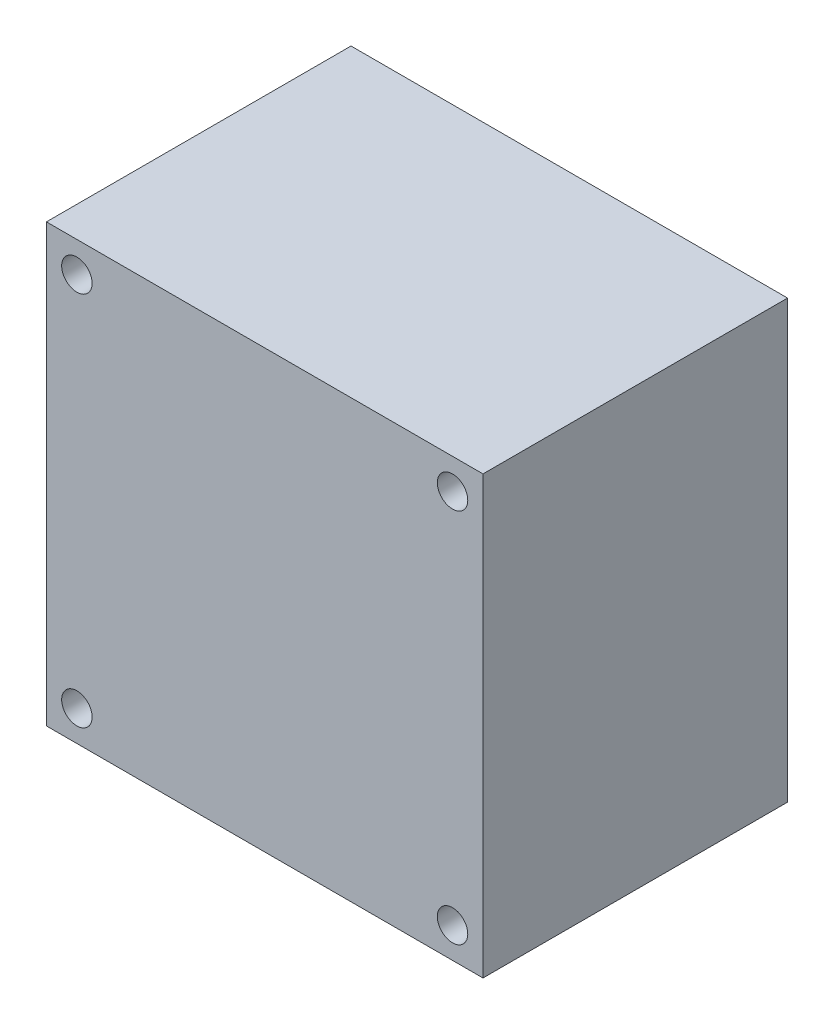
ISO-10303-21;
HEADER;
FILE_DESCRIPTION(('STEP AP214'),'2;1');
FILE_NAME('part.step','',(''),(''),'','','');
FILE_SCHEMA(('AUTOMOTIVE_DESIGN { 1 0 10303 214 1 1 1 1 }'));
ENDSEC;
DATA;
#1=APPLICATION_CONTEXT('core data for automotive mechanical design processes');
#2=APPLICATION_PROTOCOL_DEFINITION('international standard','automotive_design',2000,#1);
#3=PRODUCT_CONTEXT('',#1,'mechanical');
#4=PRODUCT('Part','Part','',(#3));
#5=PRODUCT_RELATED_PRODUCT_CATEGORY('part','',(#4));
#6=PRODUCT_DEFINITION_FORMATION('','',#4);
#7=PRODUCT_DEFINITION_CONTEXT('part definition',#1,'design');
#8=PRODUCT_DEFINITION('design','',#6,#7);
#9=PRODUCT_DEFINITION_SHAPE('','',#8);
#10=(LENGTH_UNIT() NAMED_UNIT(*) SI_UNIT(.MILLI.,.METRE.));
#11=(NAMED_UNIT(*) PLANE_ANGLE_UNIT() SI_UNIT($,.RADIAN.));
#12=(NAMED_UNIT(*) SI_UNIT($,.STERADIAN.) SOLID_ANGLE_UNIT());
#13=UNCERTAINTY_MEASURE_WITH_UNIT(LENGTH_MEASURE(1.E-05),#10,'distance_accuracy_value','');
#14=(GEOMETRIC_REPRESENTATION_CONTEXT(3) GLOBAL_UNCERTAINTY_ASSIGNED_CONTEXT((#13)) GLOBAL_UNIT_ASSIGNED_CONTEXT((#10,
#11,#12)) REPRESENTATION_CONTEXT('',''));
#15=CARTESIAN_POINT('',(0.,0.,0.));
#16=DIRECTION('',(0.,0.,1.));
#17=DIRECTION('',(1.,0.,0.));
#18=AXIS2_PLACEMENT_3D('',#15,#16,#17);
#19=CARTESIAN_POINT('',(0.,0.,30.));
#20=DIRECTION('',(1.,0.,0.));
#21=DIRECTION('',(0.,0.,-1.));
#22=AXIS2_PLACEMENT_3D('',#19,#20,#21);
#23=PLANE('',#22);
#24=DIRECTION('',(0.,-1.,0.));
#25=VECTOR('',#24,1.);
#26=CARTESIAN_POINT('',(0.,0.,0.));
#27=LINE('',#26,#25);
#28=CARTESIAN_POINT('',(0.,43.,0.));
#29=VERTEX_POINT('',#28);
#30=CARTESIAN_POINT('',(0.,0.,0.));
#31=VERTEX_POINT('',#30);
#32=EDGE_CURVE('E95',#29,#31,#27,.T.);
#33=ORIENTED_EDGE('',*,*,#32,.T.);
#34=DIRECTION('',(0.,0.,-1.));
#35=VECTOR('',#34,1.);
#36=CARTESIAN_POINT('',(0.,0.,30.));
#37=LINE('',#36,#35);
#38=CARTESIAN_POINT('',(0.,0.,30.));
#39=VERTEX_POINT('',#38);
#40=EDGE_CURVE('E11',#39,#31,#37,.T.);
#41=ORIENTED_EDGE('',*,*,#40,.F.);
#42=DIRECTION('',(0.,-1.,0.));
#43=VECTOR('',#42,1.);
#44=CARTESIAN_POINT('',(0.,0.,30.));
#45=LINE('',#44,#43);
#46=CARTESIAN_POINT('',(0.,43.,30.));
#47=VERTEX_POINT('',#46);
#48=EDGE_CURVE('E83',#47,#39,#45,.T.);
#49=ORIENTED_EDGE('',*,*,#48,.F.);
#50=DIRECTION('',(0.,0.,-1.));
#51=VECTOR('',#50,1.);
#52=CARTESIAN_POINT('',(0.,43.,30.));
#53=LINE('',#52,#51);
#54=EDGE_CURVE('E91',#47,#29,#53,.T.);
#55=ORIENTED_EDGE('',*,*,#54,.T.);
#56=EDGE_LOOP('',(#33,#41,#49,#55));
#57=FACE_BOUND('',#56,.T.);
#58=ADVANCED_FACE('F32',(#57),#23,.F.);
#59=CARTESIAN_POINT('',(0.,0.,30.));
#60=DIRECTION('',(0.,1.,0.));
#61=DIRECTION('',(0.,0.,1.));
#62=AXIS2_PLACEMENT_3D('',#59,#60,#61);
#63=PLANE('',#62);
#64=DIRECTION('',(1.,0.,0.));
#65=VECTOR('',#64,1.);
#66=CARTESIAN_POINT('',(0.,0.,0.));
#67=LINE('',#66,#65);
#68=CARTESIAN_POINT('',(43.,0.,0.));
#69=VERTEX_POINT('',#68);
#70=EDGE_CURVE('E87',#31,#69,#67,.T.);
#71=ORIENTED_EDGE('',*,*,#70,.T.);
#72=DIRECTION('',(0.,0.,-1.));
#73=VECTOR('',#72,1.);
#74=CARTESIAN_POINT('',(43.,0.,30.));
#75=LINE('',#74,#73);
#76=CARTESIAN_POINT('',(43.,0.,30.));
#77=VERTEX_POINT('',#76);
#78=EDGE_CURVE('E40',#77,#69,#75,.T.);
#79=ORIENTED_EDGE('',*,*,#78,.F.);
#80=DIRECTION('',(1.,0.,0.));
#81=VECTOR('',#80,1.);
#82=CARTESIAN_POINT('',(0.,0.,30.));
#83=LINE('',#82,#81);
#84=EDGE_CURVE('E78',#39,#77,#83,.T.);
#85=ORIENTED_EDGE('',*,*,#84,.F.);
#86=ORIENTED_EDGE('',*,*,#40,.T.);
#87=EDGE_LOOP('',(#71,#79,#85,#86));
#88=FACE_BOUND('',#87,.T.);
#89=ADVANCED_FACE('F86',(#88),#63,.F.);
#90=CARTESIAN_POINT('',(43.,0.,30.));
#91=DIRECTION('',(-1.,0.,0.));
#92=DIRECTION('',(0.,0.,1.));
#93=AXIS2_PLACEMENT_3D('',#90,#91,#92);
#94=PLANE('',#93);
#95=DIRECTION('',(0.,1.,0.));
#96=VECTOR('',#95,1.);
#97=CARTESIAN_POINT('',(43.,0.,0.));
#98=LINE('',#97,#96);
#99=CARTESIAN_POINT('',(43.,43.,0.));
#100=VERTEX_POINT('',#99);
#101=EDGE_CURVE('E65',#69,#100,#98,.T.);
#102=ORIENTED_EDGE('',*,*,#101,.T.);
#103=DIRECTION('',(0.,0.,-1.));
#104=VECTOR('',#103,1.);
#105=CARTESIAN_POINT('',(43.,43.,30.));
#106=LINE('',#105,#104);
#107=CARTESIAN_POINT('',(43.,43.,30.));
#108=VERTEX_POINT('',#107);
#109=EDGE_CURVE('E88',#108,#100,#106,.T.);
#110=ORIENTED_EDGE('',*,*,#109,.F.);
#111=DIRECTION('',(0.,1.,0.));
#112=VECTOR('',#111,1.);
#113=CARTESIAN_POINT('',(43.,0.,30.));
#114=LINE('',#113,#112);
#115=EDGE_CURVE('E81',#77,#108,#114,.T.);
#116=ORIENTED_EDGE('',*,*,#115,.F.);
#117=ORIENTED_EDGE('',*,*,#78,.T.);
#118=EDGE_LOOP('',(#102,#110,#116,#117));
#119=FACE_BOUND('',#118,.T.);
#120=ADVANCED_FACE('F89',(#119),#94,.F.);
#121=CARTESIAN_POINT('',(0.,43.,30.));
#122=DIRECTION('',(0.,-1.,0.));
#123=DIRECTION('',(0.,0.,-1.));
#124=AXIS2_PLACEMENT_3D('',#121,#122,#123);
#125=PLANE('',#124);
#126=DIRECTION('',(-1.,0.,0.));
#127=VECTOR('',#126,1.);
#128=CARTESIAN_POINT('',(0.,43.,0.));
#129=LINE('',#128,#127);
#130=EDGE_CURVE('E71',#100,#29,#129,.T.);
#131=ORIENTED_EDGE('',*,*,#130,.T.);
#132=ORIENTED_EDGE('',*,*,#54,.F.);
#133=DIRECTION('',(-1.,0.,0.));
#134=VECTOR('',#133,1.);
#135=CARTESIAN_POINT('',(0.,43.,30.));
#136=LINE('',#135,#134);
#137=EDGE_CURVE('E48',#108,#47,#136,.T.);
#138=ORIENTED_EDGE('',*,*,#137,.F.);
#139=ORIENTED_EDGE('',*,*,#109,.T.);
#140=EDGE_LOOP('',(#131,#132,#138,#139));
#141=FACE_BOUND('',#140,.T.);
#142=ADVANCED_FACE('F103',(#141),#125,.F.);
#143=CARTESIAN_POINT('',(0.,0.,30.));
#144=DIRECTION('',(0.,0.,-1.));
#145=DIRECTION('',(-1.,0.,0.));
#146=AXIS2_PLACEMENT_3D('',#143,#144,#145);
#147=PLANE('',#146);
#148=CARTESIAN_POINT('',(3.,3.,30.));
#149=DIRECTION('',(0.,0.,1.));
#150=DIRECTION('',(1.,0.,0.));
#151=AXIS2_PLACEMENT_3D('',#148,#149,#150);
#152=CIRCLE('',#151,1.5);
#153=CARTESIAN_POINT('',(4.5,3.,30.));
#154=VERTEX_POINT('',#153);
#155=EDGE_CURVE('E127',#154,#154,#152,.T.);
#156=ORIENTED_EDGE('',*,*,#155,.F.);
#157=EDGE_LOOP('',(#156));
#158=FACE_BOUND('',#157,.T.);
#159=CARTESIAN_POINT('',(40.,3.,30.));
#160=DIRECTION('',(0.,0.,1.));
#161=DIRECTION('',(1.,0.,0.));
#162=AXIS2_PLACEMENT_3D('',#159,#160,#161);
#163=CIRCLE('',#162,1.5);
#164=CARTESIAN_POINT('',(41.5,3.,30.));
#165=VERTEX_POINT('',#164);
#166=EDGE_CURVE('E121',#165,#165,#163,.T.);
#167=ORIENTED_EDGE('',*,*,#166,.F.);
#168=EDGE_LOOP('',(#167));
#169=FACE_BOUND('',#168,.T.);
#170=CARTESIAN_POINT('',(40.,40.,30.));
#171=DIRECTION('',(0.,0.,1.));
#172=DIRECTION('',(1.,0.,0.));
#173=AXIS2_PLACEMENT_3D('',#170,#171,#172);
#174=CIRCLE('',#173,1.5);
#175=CARTESIAN_POINT('',(41.5,40.,30.));
#176=VERTEX_POINT('',#175);
#177=EDGE_CURVE('E115',#176,#176,#174,.T.);
#178=ORIENTED_EDGE('',*,*,#177,.F.);
#179=EDGE_LOOP('',(#178));
#180=FACE_BOUND('',#179,.T.);
#181=CARTESIAN_POINT('',(3.,40.,30.));
#182=DIRECTION('',(0.,0.,1.));
#183=DIRECTION('',(1.,0.,0.));
#184=AXIS2_PLACEMENT_3D('',#181,#182,#183);
#185=CIRCLE('',#184,1.5);
#186=CARTESIAN_POINT('',(4.5,40.,30.));
#187=VERTEX_POINT('',#186);
#188=EDGE_CURVE('E109',#187,#187,#185,.T.);
#189=ORIENTED_EDGE('',*,*,#188,.F.);
#190=EDGE_LOOP('',(#189));
#191=FACE_BOUND('',#190,.T.);
#192=ORIENTED_EDGE('',*,*,#48,.T.);
#193=ORIENTED_EDGE('',*,*,#84,.T.);
#194=ORIENTED_EDGE('',*,*,#115,.T.);
#195=ORIENTED_EDGE('',*,*,#137,.T.);
#196=EDGE_LOOP('',(#192,#193,#194,#195));
#197=FACE_BOUND('',#196,.T.);
#198=ADVANCED_FACE('F79',(#158,#169,#180,#191,#197),#147,.F.);
#199=CARTESIAN_POINT('',(0.,0.,0.));
#200=DIRECTION('',(0.,0.,-1.));
#201=DIRECTION('',(-1.,0.,0.));
#202=AXIS2_PLACEMENT_3D('',#199,#200,#201);
#203=PLANE('',#202);
#204=CARTESIAN_POINT('',(3.,3.,0.));
#205=DIRECTION('',(0.,0.,1.));
#206=DIRECTION('',(1.,0.,0.));
#207=AXIS2_PLACEMENT_3D('',#204,#205,#206);
#208=CIRCLE('',#207,1.5);
#209=CARTESIAN_POINT('',(4.5,3.,0.));
#210=VERTEX_POINT('',#209);
#211=EDGE_CURVE('E124',#210,#210,#208,.T.);
#212=ORIENTED_EDGE('',*,*,#211,.T.);
#213=EDGE_LOOP('',(#212));
#214=FACE_BOUND('',#213,.T.);
#215=CARTESIAN_POINT('',(40.,3.,0.));
#216=DIRECTION('',(0.,0.,1.));
#217=DIRECTION('',(1.,0.,0.));
#218=AXIS2_PLACEMENT_3D('',#215,#216,#217);
#219=CIRCLE('',#218,1.5);
#220=CARTESIAN_POINT('',(41.5,3.,0.));
#221=VERTEX_POINT('',#220);
#222=EDGE_CURVE('E118',#221,#221,#219,.T.);
#223=ORIENTED_EDGE('',*,*,#222,.T.);
#224=EDGE_LOOP('',(#223));
#225=FACE_BOUND('',#224,.T.);
#226=CARTESIAN_POINT('',(40.,40.,0.));
#227=DIRECTION('',(0.,0.,1.));
#228=DIRECTION('',(1.,0.,0.));
#229=AXIS2_PLACEMENT_3D('',#226,#227,#228);
#230=CIRCLE('',#229,1.5);
#231=CARTESIAN_POINT('',(41.5,40.,0.));
#232=VERTEX_POINT('',#231);
#233=EDGE_CURVE('E112',#232,#232,#230,.T.);
#234=ORIENTED_EDGE('',*,*,#233,.T.);
#235=EDGE_LOOP('',(#234));
#236=FACE_BOUND('',#235,.T.);
#237=CARTESIAN_POINT('',(3.,40.,0.));
#238=DIRECTION('',(0.,0.,1.));
#239=DIRECTION('',(1.,0.,0.));
#240=AXIS2_PLACEMENT_3D('',#237,#238,#239);
#241=CIRCLE('',#240,1.5);
#242=CARTESIAN_POINT('',(4.5,40.,0.));
#243=VERTEX_POINT('',#242);
#244=EDGE_CURVE('E98',#243,#243,#241,.T.);
#245=ORIENTED_EDGE('',*,*,#244,.T.);
#246=EDGE_LOOP('',(#245));
#247=FACE_BOUND('',#246,.T.);
#248=ORIENTED_EDGE('',*,*,#32,.F.);
#249=ORIENTED_EDGE('',*,*,#130,.F.);
#250=ORIENTED_EDGE('',*,*,#101,.F.);
#251=ORIENTED_EDGE('',*,*,#70,.F.);
#252=EDGE_LOOP('',(#248,#249,#250,#251));
#253=FACE_BOUND('',#252,.T.);
#254=ADVANCED_FACE('F106',(#214,#225,#236,#247,#253),#203,.T.);
#255=CARTESIAN_POINT('',(3.,40.,0.));
#256=DIRECTION('',(0.,0.,1.));
#257=DIRECTION('',(1.,0.,0.));
#258=AXIS2_PLACEMENT_3D('',#255,#256,#257);
#259=CYLINDRICAL_SURFACE('',#258,1.5);
#260=ORIENTED_EDGE('',*,*,#244,.F.);
#261=EDGE_LOOP('',(#260));
#262=FACE_BOUND('',#261,.T.);
#263=ORIENTED_EDGE('',*,*,#188,.T.);
#264=EDGE_LOOP('',(#263));
#265=FACE_BOUND('',#264,.T.);
#266=ADVANCED_FACE('F151',(#262,#265),#259,.F.);
#267=CARTESIAN_POINT('',(40.,40.,0.));
#268=DIRECTION('',(0.,0.,1.));
#269=DIRECTION('',(1.,0.,0.));
#270=AXIS2_PLACEMENT_3D('',#267,#268,#269);
#271=CYLINDRICAL_SURFACE('',#270,1.5);
#272=ORIENTED_EDGE('',*,*,#233,.F.);
#273=EDGE_LOOP('',(#272));
#274=FACE_BOUND('',#273,.T.);
#275=ORIENTED_EDGE('',*,*,#177,.T.);
#276=EDGE_LOOP('',(#275));
#277=FACE_BOUND('',#276,.T.);
#278=ADVANCED_FACE('F153',(#274,#277),#271,.F.);
#279=CARTESIAN_POINT('',(40.,3.,0.));
#280=DIRECTION('',(0.,0.,1.));
#281=DIRECTION('',(1.,0.,0.));
#282=AXIS2_PLACEMENT_3D('',#279,#280,#281);
#283=CYLINDRICAL_SURFACE('',#282,1.5);
#284=ORIENTED_EDGE('',*,*,#222,.F.);
#285=EDGE_LOOP('',(#284));
#286=FACE_BOUND('',#285,.T.);
#287=ORIENTED_EDGE('',*,*,#166,.T.);
#288=EDGE_LOOP('',(#287));
#289=FACE_BOUND('',#288,.T.);
#290=ADVANCED_FACE('F138',(#286,#289),#283,.F.);
#291=CARTESIAN_POINT('',(3.,3.,0.));
#292=DIRECTION('',(0.,0.,1.));
#293=DIRECTION('',(1.,0.,0.));
#294=AXIS2_PLACEMENT_3D('',#291,#292,#293);
#295=CYLINDRICAL_SURFACE('',#294,1.5);
#296=ORIENTED_EDGE('',*,*,#211,.F.);
#297=EDGE_LOOP('',(#296));
#298=FACE_BOUND('',#297,.T.);
#299=ORIENTED_EDGE('',*,*,#155,.T.);
#300=EDGE_LOOP('',(#299));
#301=FACE_BOUND('',#300,.T.);
#302=ADVANCED_FACE('F135',(#298,#301),#295,.F.);
#303=CLOSED_SHELL('',(#58,#89,#120,#142,#198,#254,#266,#278,#290,#302));
#304=MANIFOLD_SOLID_BREP('B2',#303);
#305=ADVANCED_BREP_SHAPE_REPRESENTATION('',(#18,#304),#14);
#306=SHAPE_DEFINITION_REPRESENTATION(#9,#305);
ENDSEC;
END-ISO-10303-21;
